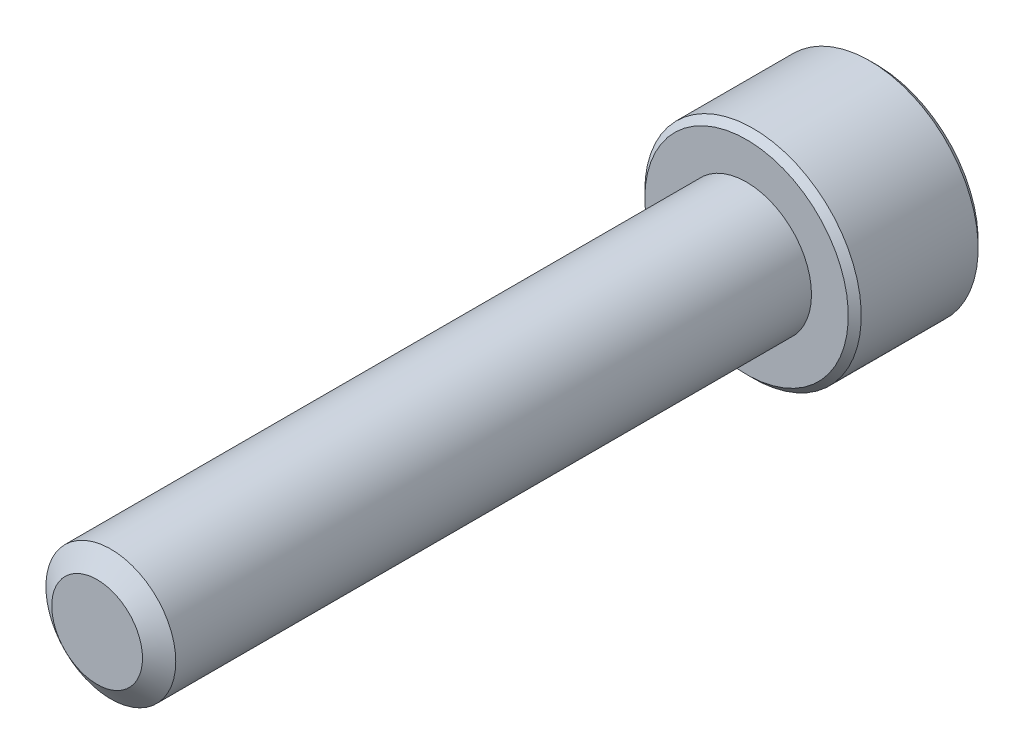
ISO-10303-21;
HEADER;
FILE_DESCRIPTION(('STEP AP214'),'2;1');
FILE_NAME('part.step','',(''),(''),'','','');
FILE_SCHEMA(('AUTOMOTIVE_DESIGN { 1 0 10303 214 1 1 1 1 }'));
ENDSEC;
DATA;
#1=APPLICATION_CONTEXT('core data for automotive mechanical design processes');
#2=APPLICATION_PROTOCOL_DEFINITION('international standard','automotive_design',2000,#1);
#3=PRODUCT_CONTEXT('',#1,'mechanical');
#4=PRODUCT('Part','Part','',(#3));
#5=PRODUCT_RELATED_PRODUCT_CATEGORY('part','',(#4));
#6=PRODUCT_DEFINITION_FORMATION('','',#4);
#7=PRODUCT_DEFINITION_CONTEXT('part definition',#1,'design');
#8=PRODUCT_DEFINITION('design','',#6,#7);
#9=PRODUCT_DEFINITION_SHAPE('','',#8);
#10=(LENGTH_UNIT() NAMED_UNIT(*) SI_UNIT(.MILLI.,.METRE.));
#11=(NAMED_UNIT(*) PLANE_ANGLE_UNIT() SI_UNIT($,.RADIAN.));
#12=(NAMED_UNIT(*) SI_UNIT($,.STERADIAN.) SOLID_ANGLE_UNIT());
#13=UNCERTAINTY_MEASURE_WITH_UNIT(LENGTH_MEASURE(1.E-05),#10,'distance_accuracy_value','');
#14=(GEOMETRIC_REPRESENTATION_CONTEXT(3) GLOBAL_UNCERTAINTY_ASSIGNED_CONTEXT((#13)) GLOBAL_UNIT_ASSIGNED_CONTEXT((#10,
#11,#12)) REPRESENTATION_CONTEXT('',''));
#15=CARTESIAN_POINT('',(0.,0.,0.));
#16=DIRECTION('',(0.,0.,1.));
#17=DIRECTION('',(1.,0.,0.));
#18=AXIS2_PLACEMENT_3D('',#15,#16,#17);
#19=CARTESIAN_POINT('',(0.,0.,-30.));
#20=DIRECTION('',(0.,0.,1.));
#21=DIRECTION('',(1.,0.,0.));
#22=AXIS2_PLACEMENT_3D('',#19,#20,#21);
#23=CYLINDRICAL_SURFACE('',#22,3.);
#24=CARTESIAN_POINT('',(0.,0.,-0.632650851713494));
#25=DIRECTION('',(0.,0.,1.));
#26=DIRECTION('',(1.,0.,0.));
#27=AXIS2_PLACEMENT_3D('',#24,#25,#26);
#28=CIRCLE('',#27,3.);
#29=CARTESIAN_POINT('',(3.,0.,-0.632650851713494));
#30=VERTEX_POINT('',#29);
#31=EDGE_CURVE('E115',#30,#30,#28,.T.);
#32=ORIENTED_EDGE('',*,*,#31,.F.);
#33=EDGE_LOOP('',(#32));
#34=FACE_BOUND('',#33,.T.);
#35=CARTESIAN_POINT('',(0.,0.,-30.));
#36=DIRECTION('',(0.,0.,-1.));
#37=DIRECTION('',(-1.,0.,0.));
#38=AXIS2_PLACEMENT_3D('',#35,#36,#37);
#39=CIRCLE('',#38,3.);
#40=CARTESIAN_POINT('',(-3.,0.,-30.));
#41=VERTEX_POINT('',#40);
#42=EDGE_CURVE('E221',#41,#41,#39,.F.);
#43=ORIENTED_EDGE('',*,*,#42,.T.);
#44=EDGE_LOOP('',(#43));
#45=FACE_BOUND('',#44,.T.);
#46=ADVANCED_FACE('F41',(#34,#45),#23,.T.);
#47=CARTESIAN_POINT('',(0.,0.,0.));
#48=DIRECTION('',(0.,0.,-1.));
#49=DIRECTION('',(-1.,0.,0.));
#50=AXIS2_PLACEMENT_3D('',#47,#48,#49);
#51=CONICAL_SURFACE('',#50,2.09648094716167,0.959931088596884);
#52=ORIENTED_EDGE('',*,*,#31,.T.);
#53=EDGE_LOOP('',(#52));
#54=FACE_BOUND('',#53,.T.);
#55=CARTESIAN_POINT('',(0.,0.,0.));
#56=DIRECTION('',(0.,0.,1.));
#57=DIRECTION('',(1.,0.,0.));
#58=AXIS2_PLACEMENT_3D('',#55,#56,#57);
#59=CIRCLE('',#58,2.09648094716167);
#60=CARTESIAN_POINT('',(2.09648094716167,0.,0.));
#61=VERTEX_POINT('',#60);
#62=EDGE_CURVE('E219',#61,#61,#59,.T.);
#63=ORIENTED_EDGE('',*,*,#62,.F.);
#64=EDGE_LOOP('',(#63));
#65=FACE_BOUND('',#64,.T.);
#66=ADVANCED_FACE('F202',(#54,#65),#51,.T.);
#67=CARTESIAN_POINT('',(0.,0.,0.));
#68=DIRECTION('',(0.,0.,1.));
#69=DIRECTION('',(1.,0.,0.));
#70=AXIS2_PLACEMENT_3D('',#67,#68,#69);
#71=PLANE('',#70);
#72=ORIENTED_EDGE('',*,*,#62,.T.);
#73=EDGE_LOOP('',(#72));
#74=FACE_BOUND('',#73,.T.);
#75=ADVANCED_FACE('F199',(#74),#71,.T.);
#76=CARTESIAN_POINT('',(0.,0.,-36.));
#77=DIRECTION('',(0.,0.,1.));
#78=DIRECTION('',(1.,0.,0.));
#79=AXIS2_PLACEMENT_3D('',#76,#77,#78);
#80=CYLINDRICAL_SURFACE('',#79,5.);
#81=CARTESIAN_POINT('',(0.,0.,-35.7));
#82=DIRECTION('',(0.,0.,-1.));
#83=DIRECTION('',(-1.,0.,0.));
#84=AXIS2_PLACEMENT_3D('',#81,#82,#83);
#85=CIRCLE('',#84,5.);
#86=CARTESIAN_POINT('',(-5.,0.,-35.7));
#87=VERTEX_POINT('',#86);
#88=EDGE_CURVE('E49',#87,#87,#85,.F.);
#89=ORIENTED_EDGE('',*,*,#88,.T.);
#90=EDGE_LOOP('',(#89));
#91=FACE_BOUND('',#90,.T.);
#92=CARTESIAN_POINT('',(0.,0.,-30.3));
#93=DIRECTION('',(0.,0.,-1.));
#94=DIRECTION('',(-1.,0.,0.));
#95=AXIS2_PLACEMENT_3D('',#92,#93,#94);
#96=CIRCLE('',#95,5.);
#97=CARTESIAN_POINT('',(-5.,0.,-30.3));
#98=VERTEX_POINT('',#97);
#99=EDGE_CURVE('E178',#98,#98,#96,.T.);
#100=ORIENTED_EDGE('',*,*,#99,.T.);
#101=EDGE_LOOP('',(#100));
#102=FACE_BOUND('',#101,.T.);
#103=ADVANCED_FACE('F183',(#91,#102),#80,.T.);
#104=CARTESIAN_POINT('',(0.,0.,-36.));
#105=DIRECTION('',(0.,0.,-1.));
#106=DIRECTION('',(-1.,0.,0.));
#107=AXIS2_PLACEMENT_3D('',#104,#105,#106);
#108=PLANE('',#107);
#109=CARTESIAN_POINT('',(0.,0.,-36.));
#110=DIRECTION('',(0.,0.,-1.));
#111=DIRECTION('',(-1.,0.,0.));
#112=AXIS2_PLACEMENT_3D('',#109,#110,#111);
#113=CIRCLE('',#112,4.69999999999999);
#114=CARTESIAN_POINT('',(-4.69999999999999,0.,-36.));
#115=VERTEX_POINT('',#114);
#116=EDGE_CURVE('E114',#115,#115,#113,.T.);
#117=ORIENTED_EDGE('',*,*,#116,.T.);
#118=EDGE_LOOP('',(#117));
#119=FACE_BOUND('',#118,.T.);
#120=CARTESIAN_POINT('',(0.,0.,-36.));
#121=DIRECTION('',(0.,0.,-1.));
#122=DIRECTION('',(-1.,0.,0.));
#123=AXIS2_PLACEMENT_3D('',#120,#121,#122);
#124=CIRCLE('',#123,2.88675134594813);
#125=CARTESIAN_POINT('',(-2.5,1.44337567297407,-36.));
#126=VERTEX_POINT('',#125);
#127=CARTESIAN_POINT('',(0.,2.88675134594813,-36.));
#128=VERTEX_POINT('',#127);
#129=EDGE_CURVE('E95',#126,#128,#124,.T.);
#130=ORIENTED_EDGE('',*,*,#129,.F.);
#131=CARTESIAN_POINT('',(-2.5,-1.44337567297406,-36.));
#132=VERTEX_POINT('',#131);
#133=EDGE_CURVE('E55',#132,#126,#124,.T.);
#134=ORIENTED_EDGE('',*,*,#133,.F.);
#135=CARTESIAN_POINT('',(0.,-2.88675134594813,-36.));
#136=VERTEX_POINT('',#135);
#137=EDGE_CURVE('E281',#136,#132,#124,.T.);
#138=ORIENTED_EDGE('',*,*,#137,.F.);
#139=CARTESIAN_POINT('',(2.5,-1.44337567297406,-36.));
#140=VERTEX_POINT('',#139);
#141=EDGE_CURVE('E62',#140,#136,#124,.T.);
#142=ORIENTED_EDGE('',*,*,#141,.F.);
#143=CARTESIAN_POINT('',(2.5,1.44337567297407,-36.));
#144=VERTEX_POINT('',#143);
#145=EDGE_CURVE('E136',#144,#140,#124,.T.);
#146=ORIENTED_EDGE('',*,*,#145,.F.);
#147=EDGE_CURVE('E104',#128,#144,#124,.T.);
#148=ORIENTED_EDGE('',*,*,#147,.F.);
#149=EDGE_LOOP('',(#130,#134,#138,#142,#146,#148));
#150=FACE_BOUND('',#149,.T.);
#151=ADVANCED_FACE('F135',(#119,#150),#108,.T.);
#152=CARTESIAN_POINT('',(0.,0.,-30.));
#153=DIRECTION('',(0.,0.,-1.));
#154=DIRECTION('',(-1.,0.,0.));
#155=AXIS2_PLACEMENT_3D('',#152,#153,#154);
#156=PLANE('',#155);
#157=CARTESIAN_POINT('',(0.,0.,-30.));
#158=DIRECTION('',(0.,0.,-1.));
#159=DIRECTION('',(-1.,0.,0.));
#160=AXIS2_PLACEMENT_3D('',#157,#158,#159);
#161=CIRCLE('',#160,4.7);
#162=CARTESIAN_POINT('',(-4.7,0.,-30.));
#163=VERTEX_POINT('',#162);
#164=EDGE_CURVE('E11',#163,#163,#161,.F.);
#165=ORIENTED_EDGE('',*,*,#164,.T.);
#166=EDGE_LOOP('',(#165));
#167=FACE_BOUND('',#166,.T.);
#168=ORIENTED_EDGE('',*,*,#42,.F.);
#169=EDGE_LOOP('',(#168));
#170=FACE_BOUND('',#169,.T.);
#171=ADVANCED_FACE('F192',(#167,#170),#156,.F.);
#172=CARTESIAN_POINT('',(0.,0.,-36.));
#173=DIRECTION('',(0.,0.,-1.));
#174=DIRECTION('',(-1.,0.,0.));
#175=AXIS2_PLACEMENT_3D('',#172,#173,#174);
#176=CONICAL_SURFACE('',#175,2.88675134594813,0.78539816339745);
#177=ORIENTED_EDGE('',*,*,#147,.T.);
#178=CARTESIAN_POINT('',(-0.000199999999999044,2.88686681600197,-36.0001154769818));
#179=CARTESIAN_POINT('',(0.0857382777877649,2.83725032818751,-35.9505407053547));
#180=CARTESIAN_POINT('',(0.173113567275754,2.7868041812811,-35.9038774813625));
#181=CARTESIAN_POINT('',(0.35128145616559,2.6839389026696,-35.8184381400383));
#182=CARTESIAN_POINT('',(0.442091000681077,2.6315099876986,-35.779709562406));
#183=CARTESIAN_POINT('',(0.625204123126923,2.52578957716234,-35.7133667038977));
#184=CARTESIAN_POINT('',(0.717461064529343,2.47252500720904,-35.6855856685309));
#185=CARTESIAN_POINT('',(0.904006008776288,2.3648232334321,-35.6427831759107));
#186=CARTESIAN_POINT('',(0.998288312566285,2.31038931995913,-35.6277297666713));
#187=CARTESIAN_POINT('',(1.16077825829185,2.21657570605387,-35.6141477222095));
#188=CARTESIAN_POINT('',(1.22877596788015,2.17731721011878,-35.6121370992408));
#189=CARTESIAN_POINT('',(1.36466024116922,2.0988643883567,-35.6155241171875));
#190=CARTESIAN_POINT('',(1.43254675755224,2.05967008984862,-35.6209243552998));
#191=CARTESIAN_POINT('',(1.56767878823611,1.98165157555715,-35.6388257884025));
#192=CARTESIAN_POINT('',(1.63492349975356,1.94282782326097,-35.6513349270465));
#193=CARTESIAN_POINT('',(1.7682501008182,1.86585167424616,-35.6827675019557));
#194=CARTESIAN_POINT('',(1.83433207909966,1.82769922629678,-35.7016904464968));
#195=CARTESIAN_POINT('',(2.00359634669127,1.72997445583858,-35.7578673614082));
#196=CARTESIAN_POINT('',(2.10572912222289,1.67100807039231,-35.7993558315962));
#197=CARTESIAN_POINT('',(2.25590641494051,1.58430317001562,-35.8693940467231));
#198=CARTESIAN_POINT('',(2.30539653988261,1.55573003305807,-35.8940022521161));
#199=CARTESIAN_POINT('',(2.40346006383884,1.49911303110426,-35.9454618867152));
#200=CARTESIAN_POINT('',(2.45203400349693,1.47106885396706,-35.9723119387794));
#201=CARTESIAN_POINT('',(2.5002,1.44326020292023,-36.0001154769818));
#202=B_SPLINE_CURVE_WITH_KNOTS('',3,(#178,#179,#180,#181,#182,#183,#184,#185,#186,#187,#188,
#189,#190,#191,#192,#193,#194,#195,#196,#197,#198,#199,#200,#201),.UNSPECIFIED.,.F.,.F.,(4,2,2,
2,2,2,2,2,2,2,2,4),(0.,0.333012085133923,0.667964518301397,0.997597032043299,1.32639954393844,
1.56169424147169,1.79707142102083,2.03271213522171,2.26833478775651,2.64260240809533,
2.82922877818863,3.01574133749024),.UNSPECIFIED.);
#203=EDGE_CURVE('E109',#128,#144,#202,.T.);
#204=ORIENTED_EDGE('',*,*,#203,.F.);
#205=EDGE_LOOP('',(#177,#204));
#206=FACE_BOUND('',#205,.T.);
#207=ADVANCED_FACE('F110',(#206),#176,.F.);
#208=ORIENTED_EDGE('',*,*,#145,.T.);
#209=CARTESIAN_POINT('',(2.5,-2.87868021616155,-36.9259641937847));
#210=CARTESIAN_POINT('',(2.5,-2.80858751756355,-36.8730547693995));
#211=CARTESIAN_POINT('',(2.5,-2.73810237384458,-36.8206567848065));
#212=CARTESIAN_POINT('',(2.5,-2.5961923890747,-36.7171126835152));
#213=CARTESIAN_POINT('',(2.5,-2.52476731657143,-36.6659668843779));
#214=CARTESIAN_POINT('',(2.5,-2.38030019419698,-36.5647924979814));
#215=CARTESIAN_POINT('',(2.5,-2.307249903594,-36.5147756377845));
#216=CARTESIAN_POINT('',(2.5,-2.15990937397294,-36.4166088439155));
#217=CARTESIAN_POINT('',(2.5,-2.08561922308944,-36.3684587783455));
#218=CARTESIAN_POINT('',(2.5,-1.93130274871409,-36.271746559452));
#219=CARTESIAN_POINT('',(2.5,-1.8511916849785,-36.2233189325373));
#220=CARTESIAN_POINT('',(2.5,-1.68912282627168,-36.1296640597041));
#221=CARTESIAN_POINT('',(2.5,-1.60716527674864,-36.0844363916948));
#222=CARTESIAN_POINT('',(2.5,-1.44137668632319,-35.9981353746693));
#223=CARTESIAN_POINT('',(2.5,-1.35755175925796,-35.9570503726636));
#224=CARTESIAN_POINT('',(2.5,-1.1876157775942,-35.8799618661066));
#225=CARTESIAN_POINT('',(2.5,-1.10150577924729,-35.8439560607346));
#226=CARTESIAN_POINT('',(2.5,-0.933895283730374,-35.7809497442851));
#227=CARTESIAN_POINT('',(2.5,-0.852581486652412,-35.7534577201431));
#228=CARTESIAN_POINT('',(2.5,-0.687996185051424,-35.7049971144174));
#229=CARTESIAN_POINT('',(2.5,-0.604724546085161,-35.684028982239));
#230=CARTESIAN_POINT('',(2.5,-0.438105786501647,-35.650059995013));
#231=CARTESIAN_POINT('',(2.5,-0.35478695737788,-35.6369226334436));
#232=CARTESIAN_POINT('',(2.5,-0.187258638268771,-35.6188701943996));
#233=CARTESIAN_POINT('',(2.5,-0.103049303891732,-35.6139537035302));
#234=CARTESIAN_POINT('',(2.5,0.0623819458555495,-35.6127080743719));
#235=CARTESIAN_POINT('',(2.5,0.143601667742494,-35.6160745517109));
#236=CARTESIAN_POINT('',(2.5,0.305344840533964,-35.6305375923809));
#237=CARTESIAN_POINT('',(2.5,0.385868223029658,-35.6416349066531));
#238=CARTESIAN_POINT('',(2.5,0.546999992477731,-35.6711420785853));
#239=CARTESIAN_POINT('',(2.5,0.62758525815638,-35.6896763768309));
#240=CARTESIAN_POINT('',(2.5,0.786991930978588,-35.7330723320141));
#241=CARTESIAN_POINT('',(2.5,0.865813485110825,-35.7579334595174));
#242=CARTESIAN_POINT('',(2.5,1.11399280220491,-35.8455589112399));
#243=CARTESIAN_POINT('',(2.5,1.27984027529456,-35.9183033354746));
#244=CARTESIAN_POINT('',(2.5,1.52253018655038,-36.0395423452678));
#245=CARTESIAN_POINT('',(2.5,1.60256472908879,-36.0820714512072));
#246=CARTESIAN_POINT('',(2.5,1.76081489282124,-36.1703965241522));
#247=CARTESIAN_POINT('',(2.5,1.83903083842887,-36.2161919024767));
#248=CARTESIAN_POINT('',(2.5,1.99000684607168,-36.3080446787286));
#249=CARTESIAN_POINT('',(2.5,2.06284472030444,-36.3539756354245));
#250=CARTESIAN_POINT('',(2.5,2.20727164736135,-36.4477702453865));
#251=CARTESIAN_POINT('',(2.5,2.27886060500402,-36.4956340450436));
#252=CARTESIAN_POINT('',(2.5,2.42037078548403,-36.5925522363183));
#253=CARTESIAN_POINT('',(2.5,2.49030083172878,-36.6415937983162));
#254=CARTESIAN_POINT('',(2.5,2.62920524991558,-36.7409738351898));
#255=CARTESIAN_POINT('',(2.5,2.69817987937839,-36.7913119497074));
#256=CARTESIAN_POINT('',(2.5,2.76675463365823,-36.8421802976824));
#257=B_SPLINE_CURVE_WITH_KNOTS('',3,(#209,#210,#211,#212,#213,#214,#215,#216,#217,#218,#219,
#220,#221,#222,#223,#224,#225,#226,#227,#228,#229,#230,#231,#232,#233,#234,#235,#236,#237,#238,
#239,#240,#241,#242,#243,#244,#245,#246,#247,#248,#249,#250,#251,#252,#253,#254,#255,#256),
.UNSPECIFIED.,.F.,.F.,(4,2,2,2,2,2,2,2,2,2,2,2,2,2,2,2,2,2,2,2,2,2,2,4),(0.,0.263465914971112,
0.526997968323236,0.792571943279358,1.05812711983772,1.33890112548019,1.61963802629079,
1.89956181222216,2.17935838571897,2.436638876826,2.69393708705248,2.94660788173135,
3.19923523085016,3.44271854486786,3.6862255131336,3.93398926860573,4.18173229781968,
4.72334004841908,4.99521600382015,5.26704308216966,5.52534341671993,5.78366335141086,
6.03988492204047,6.29603603207541),.UNSPECIFIED.);
#258=EDGE_CURVE('E103',#144,#140,#257,.F.);
#259=ORIENTED_EDGE('',*,*,#258,.F.);
#260=EDGE_LOOP('',(#208,#259));
#261=FACE_BOUND('',#260,.T.);
#262=ADVANCED_FACE('F287',(#261),#176,.F.);
#263=ORIENTED_EDGE('',*,*,#141,.T.);
#264=CARTESIAN_POINT('',(2.5002,-1.44326020292023,-36.0001154769818));
#265=CARTESIAN_POINT('',(2.41426172221224,-1.49287669073469,-35.9505407053547));
#266=CARTESIAN_POINT('',(2.32688643272425,-1.5433228376411,-35.9038774813625));
#267=CARTESIAN_POINT('',(2.14871854383441,-1.64618811625259,-35.8184381400383));
#268=CARTESIAN_POINT('',(2.05790899931893,-1.69861703122359,-35.779709562406));
#269=CARTESIAN_POINT('',(1.87479587687308,-1.80433744175986,-35.7133667038977));
#270=CARTESIAN_POINT('',(1.78253893547066,-1.85760201171316,-35.6855856685309));
#271=CARTESIAN_POINT('',(1.59599399122371,-1.96530378549009,-35.6427831759107));
#272=CARTESIAN_POINT('',(1.50171168743372,-2.01973769896307,-35.6277297666713));
#273=CARTESIAN_POINT('',(1.33922174170815,-2.11355131286833,-35.6141477222095));
#274=CARTESIAN_POINT('',(1.27122403211985,-2.15280980880341,-35.6121370992408));
#275=CARTESIAN_POINT('',(1.13533975883078,-2.23126263056549,-35.6155241171875));
#276=CARTESIAN_POINT('',(1.06745324244776,-2.27045692907358,-35.6209243552998));
#277=CARTESIAN_POINT('',(0.932321211763893,-2.34847544336505,-35.6388257884025));
#278=CARTESIAN_POINT('',(0.865076500246439,-2.38729919566123,-35.6513349270465));
#279=CARTESIAN_POINT('',(0.731749899181801,-2.46427534467604,-35.6827675019557));
#280=CARTESIAN_POINT('',(0.665667920900343,-2.50242779262542,-35.7016904464968));
#281=CARTESIAN_POINT('',(0.496403653308735,-2.60015256308362,-35.7578673614083));
#282=CARTESIAN_POINT('',(0.394270877777106,-2.65911894852989,-35.7993558315962));
#283=CARTESIAN_POINT('',(0.244093585059492,-2.74582384890657,-35.8693940467231));
#284=CARTESIAN_POINT('',(0.194603460117393,-2.77439698586412,-35.8940022521161));
#285=CARTESIAN_POINT('',(0.0965399361611562,-2.83101398781794,-35.9454618867152));
#286=CARTESIAN_POINT('',(0.0479659965030749,-2.85905816495513,-35.9723119387794));
#287=CARTESIAN_POINT('',(-0.000199999999998498,-2.88686681600197,-36.0001154769818));
#288=B_SPLINE_CURVE_WITH_KNOTS('',3,(#264,#265,#266,#267,#268,#269,#270,#271,#272,#273,#274,
#275,#276,#277,#278,#279,#280,#281,#282,#283,#284,#285,#286,#287),.UNSPECIFIED.,.F.,.F.,(4,2,2,
2,2,2,2,2,2,2,2,4),(0.,0.333012085133922,0.667964518301395,0.997597032043298,1.32639954393844,
1.56169424147169,1.79707142102083,2.03271213522171,2.2683347877565,2.64260240809533,
2.82922877818863,3.01574133749024),.UNSPECIFIED.);
#289=EDGE_CURVE('E146',#140,#136,#288,.T.);
#290=ORIENTED_EDGE('',*,*,#289,.F.);
#291=EDGE_LOOP('',(#263,#290));
#292=FACE_BOUND('',#291,.T.);
#293=ADVANCED_FACE('F284',(#292),#176,.F.);
#294=ORIENTED_EDGE('',*,*,#137,.T.);
#295=CARTESIAN_POINT('',(0.000200000000000414,-2.88686681600197,-36.0001154769818));
#296=CARTESIAN_POINT('',(-0.0857382777877661,-2.83725032818751,-35.9505407053547));
#297=CARTESIAN_POINT('',(-0.173113567275755,-2.7868041812811,-35.9038774813625));
#298=CARTESIAN_POINT('',(-0.35128145616559,-2.6839389026696,-35.8184381400383));
#299=CARTESIAN_POINT('',(-0.442091000681076,-2.6315099876986,-35.779709562406));
#300=CARTESIAN_POINT('',(-0.625204123126922,-2.52578957716234,-35.7133667038977));
#301=CARTESIAN_POINT('',(-0.717461064529343,-2.47252500720904,-35.6855856685309));
#302=CARTESIAN_POINT('',(-0.904006008776289,-2.3648232334321,-35.6427831759107));
#303=CARTESIAN_POINT('',(-0.998288312566285,-2.31038931995913,-35.6277297666713));
#304=CARTESIAN_POINT('',(-1.16077825829185,-2.21657570605387,-35.6141477222095));
#305=CARTESIAN_POINT('',(-1.22877596788015,-2.17731721011878,-35.6121370992408));
#306=CARTESIAN_POINT('',(-1.36466024116922,-2.0988643883567,-35.6155241171875));
#307=CARTESIAN_POINT('',(-1.43254675755224,-2.05967008984862,-35.6209243552998));
#308=CARTESIAN_POINT('',(-1.56767878823611,-1.98165157555714,-35.6388257884025));
#309=CARTESIAN_POINT('',(-1.63492349975356,-1.94282782326096,-35.6513349270465));
#310=CARTESIAN_POINT('',(-1.7682501008182,-1.86585167424616,-35.6827675019557));
#311=CARTESIAN_POINT('',(-1.83433207909966,-1.82769922629677,-35.7016904464968));
#312=CARTESIAN_POINT('',(-2.00359634669127,-1.72997445583858,-35.7578673614082));
#313=CARTESIAN_POINT('',(-2.1057291222229,-1.67100807039231,-35.7993558315962));
#314=CARTESIAN_POINT('',(-2.25590641494051,-1.58430317001562,-35.8693940467231));
#315=CARTESIAN_POINT('',(-2.30539653988261,-1.55573003305807,-35.8940022521161));
#316=CARTESIAN_POINT('',(-2.40346006383885,-1.49911303110426,-35.9454618867152));
#317=CARTESIAN_POINT('',(-2.45203400349693,-1.47106885396706,-35.9723119387794));
#318=CARTESIAN_POINT('',(-2.5002,-1.44326020292023,-36.0001154769818));
#319=B_SPLINE_CURVE_WITH_KNOTS('',3,(#295,#296,#297,#298,#299,#300,#301,#302,#303,#304,#305,
#306,#307,#308,#309,#310,#311,#312,#313,#314,#315,#316,#317,#318),.UNSPECIFIED.,.F.,.F.,(4,2,2,
2,2,2,2,2,2,2,2,4),(0.,0.333012085133926,0.667964518301399,0.997597032043302,1.32639954393844,
1.56169424147169,1.79707142102083,2.03271213522171,2.26833478775651,2.64260240809533,
2.82922877818864,3.01574133749025),.UNSPECIFIED.);
#320=EDGE_CURVE('E258',#136,#132,#319,.T.);
#321=ORIENTED_EDGE('',*,*,#320,.F.);
#322=EDGE_LOOP('',(#294,#321));
#323=FACE_BOUND('',#322,.T.);
#324=ADVANCED_FACE('F283',(#323),#176,.F.);
#325=ORIENTED_EDGE('',*,*,#133,.T.);
#326=CARTESIAN_POINT('',(-2.5,-2.87868021616154,-36.9259641937846));
#327=CARTESIAN_POINT('',(-2.5,-2.80858751756354,-36.8730547693995));
#328=CARTESIAN_POINT('',(-2.5,-2.73810237384457,-36.8206567848064));
#329=CARTESIAN_POINT('',(-2.5,-2.59619238907469,-36.7171126835152));
#330=CARTESIAN_POINT('',(-2.5,-2.52476731657142,-36.6659668843779));
#331=CARTESIAN_POINT('',(-2.5,-2.38030019419698,-36.5647924979814));
#332=CARTESIAN_POINT('',(-2.5,-2.30724990359399,-36.5147756377845));
#333=CARTESIAN_POINT('',(-2.5,-2.15990937397294,-36.4166088439155));
#334=CARTESIAN_POINT('',(-2.5,-2.08561922308943,-36.3684587783455));
#335=CARTESIAN_POINT('',(-2.5,-1.93130274871408,-36.271746559452));
#336=CARTESIAN_POINT('',(-2.5,-1.8511916849785,-36.2233189325373));
#337=CARTESIAN_POINT('',(-2.5,-1.68912282627168,-36.1296640597041));
#338=CARTESIAN_POINT('',(-2.5,-1.60716527674864,-36.0844363916948));
#339=CARTESIAN_POINT('',(-2.5,-1.44137668632319,-35.9981353746693));
#340=CARTESIAN_POINT('',(-2.5,-1.35755175925796,-35.9570503726636));
#341=CARTESIAN_POINT('',(-2.5,-1.1876157775942,-35.8799618661066));
#342=CARTESIAN_POINT('',(-2.5,-1.10150577924729,-35.8439560607346));
#343=CARTESIAN_POINT('',(-2.5,-0.933895283730371,-35.7809497442851));
#344=CARTESIAN_POINT('',(-2.5,-0.852581486652408,-35.7534577201431));
#345=CARTESIAN_POINT('',(-2.5,-0.687996185051421,-35.7049971144174));
#346=CARTESIAN_POINT('',(-2.5,-0.604724546085159,-35.6840289822389));
#347=CARTESIAN_POINT('',(-2.5,-0.438105786501646,-35.650059995013));
#348=CARTESIAN_POINT('',(-2.5,-0.354786957377877,-35.6369226334436));
#349=CARTESIAN_POINT('',(-2.5,-0.187258638268768,-35.6188701943996));
#350=CARTESIAN_POINT('',(-2.5,-0.103049303891729,-35.6139537035302));
#351=CARTESIAN_POINT('',(-2.5,0.0623819458555519,-35.6127080743719));
#352=CARTESIAN_POINT('',(-2.5,0.143601667742497,-35.6160745517109));
#353=CARTESIAN_POINT('',(-2.5,0.305344840533967,-35.6305375923809));
#354=CARTESIAN_POINT('',(-2.5,0.385868223029661,-35.6416349066531));
#355=CARTESIAN_POINT('',(-2.5,0.546999992477734,-35.6711420785853));
#356=CARTESIAN_POINT('',(-2.5,0.627585258156383,-35.6896763768309));
#357=CARTESIAN_POINT('',(-2.5,0.786991930978591,-35.7330723320141));
#358=CARTESIAN_POINT('',(-2.5,0.865813485110828,-35.7579334595174));
#359=CARTESIAN_POINT('',(-2.5,1.11399280220491,-35.8455589112399));
#360=CARTESIAN_POINT('',(-2.5,1.27984027529457,-35.9183033354746));
#361=CARTESIAN_POINT('',(-2.5,1.52253018655039,-36.0395423452678));
#362=CARTESIAN_POINT('',(-2.5,1.60256472908879,-36.0820714512072));
#363=CARTESIAN_POINT('',(-2.5,1.76081489282125,-36.1703965241522));
#364=CARTESIAN_POINT('',(-2.5,1.83903083842887,-36.2161919024767));
#365=CARTESIAN_POINT('',(-2.5,1.99000684607168,-36.3080446787287));
#366=CARTESIAN_POINT('',(-2.5,2.06284472030445,-36.3539756354245));
#367=CARTESIAN_POINT('',(-2.5,2.20727164736136,-36.4477702453865));
#368=CARTESIAN_POINT('',(-2.5,2.27886060500403,-36.4956340450436));
#369=CARTESIAN_POINT('',(-2.5,2.42037078548403,-36.5925522363183));
#370=CARTESIAN_POINT('',(-2.5,2.49030083172879,-36.6415937983162));
#371=CARTESIAN_POINT('',(-2.5,2.62920524991559,-36.7409738351898));
#372=CARTESIAN_POINT('',(-2.5,2.6981798793784,-36.7913119497074));
#373=CARTESIAN_POINT('',(-2.5,2.76675463365824,-36.8421802976824));
#374=B_SPLINE_CURVE_WITH_KNOTS('',3,(#326,#327,#328,#329,#330,#331,#332,#333,#334,#335,#336,
#337,#338,#339,#340,#341,#342,#343,#344,#345,#346,#347,#348,#349,#350,#351,#352,#353,#354,#355,
#356,#357,#358,#359,#360,#361,#362,#363,#364,#365,#366,#367,#368,#369,#370,#371,#372,#373),
.UNSPECIFIED.,.F.,.F.,(4,2,2,2,2,2,2,2,2,2,2,2,2,2,2,2,2,2,2,2,2,2,2,4),(0.,0.263465914971115,
0.526997968323236,0.792571943279359,1.05812711983771,1.33890112548018,1.61963802629079,
1.89956181222215,2.17935838571897,2.436638876826,2.69393708705248,2.94660788173135,
3.19923523085015,3.44271854486786,3.68622551313359,3.93398926860573,4.18173229781968,
4.72334004841908,4.99521600382014,5.26704308216966,5.52534341671993,5.78366335141086,
6.03988492204047,6.29603603207542),.UNSPECIFIED.);
#375=EDGE_CURVE('E125',#132,#126,#374,.T.);
#376=ORIENTED_EDGE('',*,*,#375,.F.);
#377=EDGE_LOOP('',(#325,#376));
#378=FACE_BOUND('',#377,.T.);
#379=ADVANCED_FACE('F296',(#378),#176,.F.);
#380=ORIENTED_EDGE('',*,*,#129,.T.);
#381=CARTESIAN_POINT('',(-2.5002,1.44326020292023,-36.0001154769818));
#382=CARTESIAN_POINT('',(-2.41426172221224,1.49287669073469,-35.9505407053547));
#383=CARTESIAN_POINT('',(-2.32688643272425,1.5433228376411,-35.9038774813625));
#384=CARTESIAN_POINT('',(-2.14871854383441,1.64618811625259,-35.8184381400383));
#385=CARTESIAN_POINT('',(-2.05790899931892,1.6986170312236,-35.779709562406));
#386=CARTESIAN_POINT('',(-1.87479587687308,1.80433744175986,-35.7133667038977));
#387=CARTESIAN_POINT('',(-1.78253893547066,1.85760201171316,-35.6855856685309));
#388=CARTESIAN_POINT('',(-1.59599399122371,1.96530378549009,-35.6427831759107));
#389=CARTESIAN_POINT('',(-1.50171168743371,2.01973769896307,-35.6277297666713));
#390=CARTESIAN_POINT('',(-1.33922174170815,2.11355131286833,-35.6141477222095));
#391=CARTESIAN_POINT('',(-1.27122403211985,2.15280980880341,-35.6121370992408));
#392=CARTESIAN_POINT('',(-1.13533975883078,2.2312626305655,-35.6155241171875));
#393=CARTESIAN_POINT('',(-1.06745324244776,2.27045692907358,-35.6209243552998));
#394=CARTESIAN_POINT('',(-0.932321211763892,2.34847544336505,-35.6388257884025));
#395=CARTESIAN_POINT('',(-0.865076500246437,2.38729919566123,-35.6513349270465));
#396=CARTESIAN_POINT('',(-0.731749899181799,2.46427534467604,-35.6827675019557));
#397=CARTESIAN_POINT('',(-0.665667920900341,2.50242779262542,-35.7016904464968));
#398=CARTESIAN_POINT('',(-0.496403653308733,2.60015256308362,-35.7578673614082));
#399=CARTESIAN_POINT('',(-0.394270877777105,2.65911894852989,-35.7993558315962));
#400=CARTESIAN_POINT('',(-0.244093585059491,2.74582384890657,-35.8693940467231));
#401=CARTESIAN_POINT('',(-0.194603460117392,2.77439698586412,-35.8940022521161));
#402=CARTESIAN_POINT('',(-0.0965399361611557,2.83101398781794,-35.9454618867152));
#403=CARTESIAN_POINT('',(-0.0479659965030743,2.85905816495513,-35.9723119387794));
#404=CARTESIAN_POINT('',(0.000199999999999001,2.88686681600197,-36.0001154769818));
#405=B_SPLINE_CURVE_WITH_KNOTS('',3,(#381,#382,#383,#384,#385,#386,#387,#388,#389,#390,#391,
#392,#393,#394,#395,#396,#397,#398,#399,#400,#401,#402,#403,#404),.UNSPECIFIED.,.F.,.F.,(4,2,2,
2,2,2,2,2,2,2,2,4),(0.,0.333012085133922,0.667964518301394,0.997597032043298,1.32639954393844,
1.56169424147169,1.79707142102083,2.03271213522171,2.26833478775651,2.64260240809533,
2.82922877818863,3.01574133749024),.UNSPECIFIED.);
#406=EDGE_CURVE('E99',#126,#128,#405,.T.);
#407=ORIENTED_EDGE('',*,*,#406,.F.);
#408=EDGE_LOOP('',(#380,#407));
#409=FACE_BOUND('',#408,.T.);
#410=ADVANCED_FACE('F97',(#409),#176,.F.);
#411=CARTESIAN_POINT('',(2.5,4.33012701892219,-32.25));
#412=DIRECTION('',(0.,0.,-1.));
#413=DIRECTION('',(-1.,0.,0.));
#414=AXIS2_PLACEMENT_3D('',#411,#412,#413);
#415=PLANE('',#414);
#416=DIRECTION('',(0.866025403784439,0.5,0.));
#417=VECTOR('',#416,1.);
#418=CARTESIAN_POINT('',(-2.5,1.44337567297407,-32.25));
#419=LINE('',#418,#417);
#420=CARTESIAN_POINT('',(-2.5,1.44337567297407,-32.25));
#421=VERTEX_POINT('',#420);
#422=CARTESIAN_POINT('',(0.,2.88675134594813,-32.25));
#423=VERTEX_POINT('',#422);
#424=EDGE_CURVE('E124',#421,#423,#419,.T.);
#425=ORIENTED_EDGE('',*,*,#424,.T.);
#426=DIRECTION('',(0.866025403784439,-0.5,0.));
#427=VECTOR('',#426,1.);
#428=CARTESIAN_POINT('',(0.,2.88675134594813,-32.25));
#429=LINE('',#428,#427);
#430=CARTESIAN_POINT('',(2.5,1.44337567297406,-32.25));
#431=VERTEX_POINT('',#430);
#432=EDGE_CURVE('E129',#423,#431,#429,.T.);
#433=ORIENTED_EDGE('',*,*,#432,.T.);
#434=DIRECTION('',(0.,-1.,0.));
#435=VECTOR('',#434,1.);
#436=CARTESIAN_POINT('',(2.5,1.44337567297406,-32.25));
#437=LINE('',#436,#435);
#438=CARTESIAN_POINT('',(2.5,-1.44337567297406,-32.25));
#439=VERTEX_POINT('',#438);
#440=EDGE_CURVE('E244',#431,#439,#437,.T.);
#441=ORIENTED_EDGE('',*,*,#440,.T.);
#442=DIRECTION('',(-0.866025403784439,-0.5,0.));
#443=VECTOR('',#442,1.);
#444=CARTESIAN_POINT('',(2.5,-1.44337567297406,-32.25));
#445=LINE('',#444,#443);
#446=CARTESIAN_POINT('',(0.,-2.88675134594813,-32.25));
#447=VERTEX_POINT('',#446);
#448=EDGE_CURVE('E241',#439,#447,#445,.T.);
#449=ORIENTED_EDGE('',*,*,#448,.T.);
#450=DIRECTION('',(-0.866025403784439,0.5,0.));
#451=VECTOR('',#450,1.);
#452=CARTESIAN_POINT('',(0.,-2.88675134594813,-32.25));
#453=LINE('',#452,#451);
#454=CARTESIAN_POINT('',(-2.5,-1.44337567297406,-32.25));
#455=VERTEX_POINT('',#454);
#456=EDGE_CURVE('E238',#447,#455,#453,.T.);
#457=ORIENTED_EDGE('',*,*,#456,.T.);
#458=DIRECTION('',(0.,1.,0.));
#459=VECTOR('',#458,1.);
#460=CARTESIAN_POINT('',(-2.5,-1.44337567297406,-32.25));
#461=LINE('',#460,#459);
#462=EDGE_CURVE('E132',#455,#421,#461,.T.);
#463=ORIENTED_EDGE('',*,*,#462,.T.);
#464=EDGE_LOOP('',(#425,#433,#441,#449,#457,#463));
#465=FACE_BOUND('',#464,.T.);
#466=ADVANCED_FACE('F166',(#465),#415,.T.);
#467=CARTESIAN_POINT('',(0.,2.88675134594813,-32.25));
#468=DIRECTION('',(0.5,0.866025403784439,0.));
#469=DIRECTION('',(-0.866025403784439,0.5,0.));
#470=AXIS2_PLACEMENT_3D('',#467,#468,#469);
#471=PLANE('',#470);
#472=DIRECTION('',(0.,0.,-1.));
#473=VECTOR('',#472,1.);
#474=CARTESIAN_POINT('',(0.,2.88675134594813,-32.25));
#475=LINE('',#474,#473);
#476=EDGE_CURVE('E121',#423,#128,#475,.T.);
#477=ORIENTED_EDGE('',*,*,#476,.T.);
#478=ORIENTED_EDGE('',*,*,#203,.T.);
#479=DIRECTION('',(0.,0.,-1.));
#480=VECTOR('',#479,1.);
#481=CARTESIAN_POINT('',(2.5,1.44337567297406,-32.25));
#482=LINE('',#481,#480);
#483=EDGE_CURVE('E131',#431,#144,#482,.T.);
#484=ORIENTED_EDGE('',*,*,#483,.F.);
#485=ORIENTED_EDGE('',*,*,#432,.F.);
#486=EDGE_LOOP('',(#477,#478,#484,#485));
#487=FACE_BOUND('',#486,.T.);
#488=ADVANCED_FACE('F127',(#487),#471,.F.);
#489=CARTESIAN_POINT('',(2.5,1.44337567297406,-32.25));
#490=DIRECTION('',(1.,0.,0.));
#491=DIRECTION('',(0.,0.,-1.));
#492=AXIS2_PLACEMENT_3D('',#489,#490,#491);
#493=PLANE('',#492);
#494=ORIENTED_EDGE('',*,*,#483,.T.);
#495=ORIENTED_EDGE('',*,*,#258,.T.);
#496=DIRECTION('',(0.,0.,-1.));
#497=VECTOR('',#496,1.);
#498=CARTESIAN_POINT('',(2.5,-1.44337567297406,-32.25));
#499=LINE('',#498,#497);
#500=EDGE_CURVE('E227',#439,#140,#499,.T.);
#501=ORIENTED_EDGE('',*,*,#500,.F.);
#502=ORIENTED_EDGE('',*,*,#440,.F.);
#503=EDGE_LOOP('',(#494,#495,#501,#502));
#504=FACE_BOUND('',#503,.T.);
#505=ADVANCED_FACE('F155',(#504),#493,.F.);
#506=CARTESIAN_POINT('',(2.5,-1.44337567297406,-32.25));
#507=DIRECTION('',(0.5,-0.866025403784439,0.));
#508=DIRECTION('',(0.866025403784439,0.5,0.));
#509=AXIS2_PLACEMENT_3D('',#506,#507,#508);
#510=PLANE('',#509);
#511=ORIENTED_EDGE('',*,*,#500,.T.);
#512=ORIENTED_EDGE('',*,*,#289,.T.);
#513=DIRECTION('',(0.,0.,-1.));
#514=VECTOR('',#513,1.);
#515=CARTESIAN_POINT('',(0.,-2.88675134594813,-32.25));
#516=LINE('',#515,#514);
#517=EDGE_CURVE('E230',#447,#136,#516,.T.);
#518=ORIENTED_EDGE('',*,*,#517,.F.);
#519=ORIENTED_EDGE('',*,*,#448,.F.);
#520=EDGE_LOOP('',(#511,#512,#518,#519));
#521=FACE_BOUND('',#520,.T.);
#522=ADVANCED_FACE('F159',(#521),#510,.F.);
#523=CARTESIAN_POINT('',(0.,-2.88675134594813,-32.25));
#524=DIRECTION('',(-0.5,-0.866025403784439,0.));
#525=DIRECTION('',(0.866025403784439,-0.5,0.));
#526=AXIS2_PLACEMENT_3D('',#523,#524,#525);
#527=PLANE('',#526);
#528=ORIENTED_EDGE('',*,*,#517,.T.);
#529=ORIENTED_EDGE('',*,*,#320,.T.);
#530=DIRECTION('',(0.,0.,-1.));
#531=VECTOR('',#530,1.);
#532=CARTESIAN_POINT('',(-2.5,-1.44337567297406,-32.25));
#533=LINE('',#532,#531);
#534=EDGE_CURVE('E233',#455,#132,#533,.T.);
#535=ORIENTED_EDGE('',*,*,#534,.F.);
#536=ORIENTED_EDGE('',*,*,#456,.F.);
#537=EDGE_LOOP('',(#528,#529,#535,#536));
#538=FACE_BOUND('',#537,.T.);
#539=ADVANCED_FACE('F266',(#538),#527,.F.);
#540=CARTESIAN_POINT('',(-2.5,-1.44337567297406,-32.25));
#541=DIRECTION('',(-1.,0.,0.));
#542=DIRECTION('',(0.,0.,1.));
#543=AXIS2_PLACEMENT_3D('',#540,#541,#542);
#544=PLANE('',#543);
#545=ORIENTED_EDGE('',*,*,#534,.T.);
#546=ORIENTED_EDGE('',*,*,#375,.T.);
#547=DIRECTION('',(0.,0.,-1.));
#548=VECTOR('',#547,1.);
#549=CARTESIAN_POINT('',(-2.5,1.44337567297407,-32.25));
#550=LINE('',#549,#548);
#551=EDGE_CURVE('E123',#421,#126,#550,.T.);
#552=ORIENTED_EDGE('',*,*,#551,.F.);
#553=ORIENTED_EDGE('',*,*,#462,.F.);
#554=EDGE_LOOP('',(#545,#546,#552,#553));
#555=FACE_BOUND('',#554,.T.);
#556=ADVANCED_FACE('F263',(#555),#544,.F.);
#557=CARTESIAN_POINT('',(-2.5,1.44337567297407,-32.25));
#558=DIRECTION('',(-0.5,0.866025403784439,0.));
#559=DIRECTION('',(-0.866025403784439,-0.5,0.));
#560=AXIS2_PLACEMENT_3D('',#557,#558,#559);
#561=PLANE('',#560);
#562=ORIENTED_EDGE('',*,*,#551,.T.);
#563=ORIENTED_EDGE('',*,*,#406,.T.);
#564=ORIENTED_EDGE('',*,*,#476,.F.);
#565=ORIENTED_EDGE('',*,*,#424,.F.);
#566=EDGE_LOOP('',(#562,#563,#564,#565));
#567=FACE_BOUND('',#566,.T.);
#568=ADVANCED_FACE('F119',(#567),#561,.F.);
#569=CARTESIAN_POINT('',(0.,0.,-36.));
#570=DIRECTION('',(0.,0.,1.));
#571=DIRECTION('',(1.,0.,0.));
#572=AXIS2_PLACEMENT_3D('',#569,#570,#571);
#573=CONICAL_SURFACE('',#572,4.69999999999999,0.785398163397458);
#574=ORIENTED_EDGE('',*,*,#88,.F.);
#575=EDGE_LOOP('',(#574));
#576=FACE_BOUND('',#575,.T.);
#577=ORIENTED_EDGE('',*,*,#116,.F.);
#578=EDGE_LOOP('',(#577));
#579=FACE_BOUND('',#578,.T.);
#580=ADVANCED_FACE('F186',(#576,#579),#573,.T.);
#581=CARTESIAN_POINT('',(0.,0.,-30.3));
#582=DIRECTION('',(0.,0.,-1.));
#583=DIRECTION('',(-1.,0.,0.));
#584=AXIS2_PLACEMENT_3D('',#581,#582,#583);
#585=CONICAL_SURFACE('',#584,5.,0.785398163397453);
#586=ORIENTED_EDGE('',*,*,#164,.F.);
#587=EDGE_LOOP('',(#586));
#588=FACE_BOUND('',#587,.T.);
#589=ORIENTED_EDGE('',*,*,#99,.F.);
#590=EDGE_LOOP('',(#589));
#591=FACE_BOUND('',#590,.T.);
#592=ADVANCED_FACE('F43',(#588,#591),#585,.T.);
#593=CLOSED_SHELL('',(#46,#66,#75,#103,#151,#171,#207,#262,#293,#324,#379,#410,#466,#488,#505,
#522,#539,#556,#568,#580,#592));
#594=MANIFOLD_SOLID_BREP('B2',#593);
#595=ADVANCED_BREP_SHAPE_REPRESENTATION('',(#18,#594),#14);
#596=SHAPE_DEFINITION_REPRESENTATION(#9,#595);
ENDSEC;
END-ISO-10303-21;
